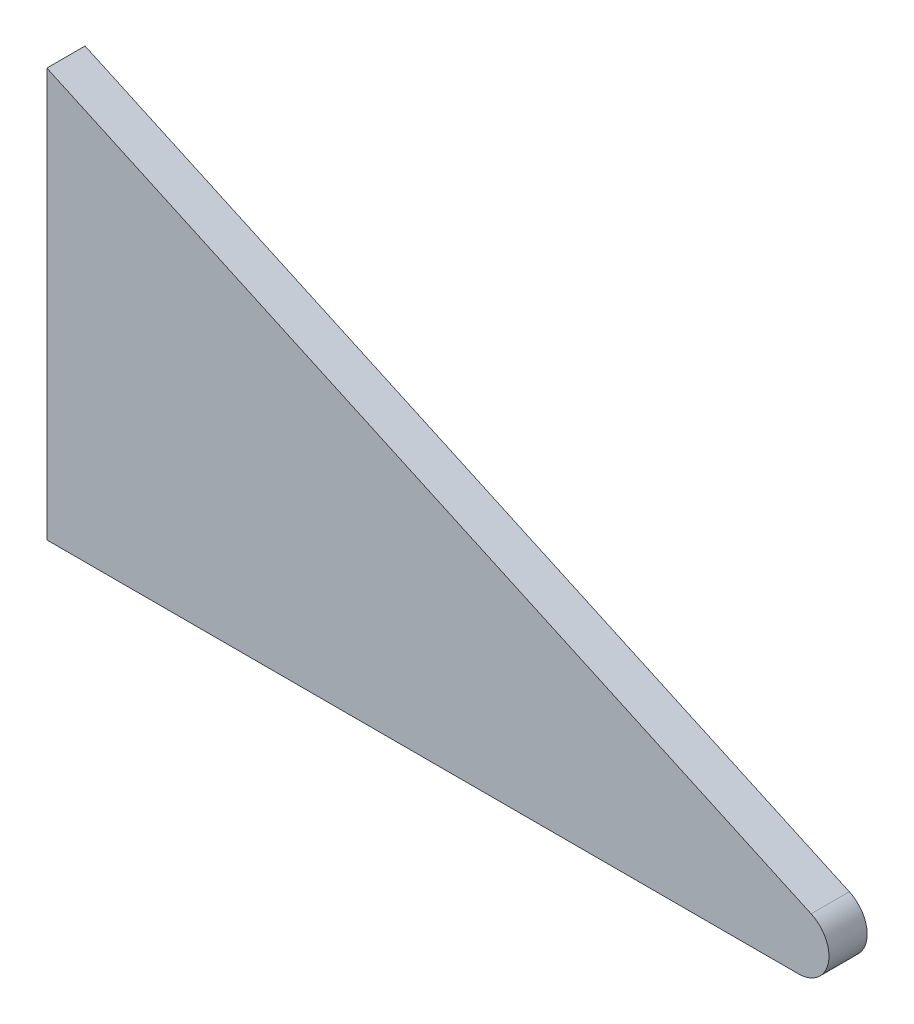
ISO-10303-21;
HEADER;
FILE_DESCRIPTION(('STEP AP214'),'2;1');
FILE_NAME('part.step','',(''),(''),'','','');
FILE_SCHEMA(('AUTOMOTIVE_DESIGN { 1 0 10303 214 1 1 1 1 }'));
ENDSEC;
DATA;
#1=APPLICATION_CONTEXT('core data for automotive mechanical design processes');
#2=APPLICATION_PROTOCOL_DEFINITION('international standard','automotive_design',2000,#1);
#3=PRODUCT_CONTEXT('',#1,'mechanical');
#4=PRODUCT('Part','Part','',(#3));
#5=PRODUCT_RELATED_PRODUCT_CATEGORY('part','',(#4));
#6=PRODUCT_DEFINITION_FORMATION('','',#4);
#7=PRODUCT_DEFINITION_CONTEXT('part definition',#1,'design');
#8=PRODUCT_DEFINITION('design','',#6,#7);
#9=PRODUCT_DEFINITION_SHAPE('','',#8);
#10=(LENGTH_UNIT() NAMED_UNIT(*) SI_UNIT(.MILLI.,.METRE.));
#11=(NAMED_UNIT(*) PLANE_ANGLE_UNIT() SI_UNIT($,.RADIAN.));
#12=(NAMED_UNIT(*) SI_UNIT($,.STERADIAN.) SOLID_ANGLE_UNIT());
#13=UNCERTAINTY_MEASURE_WITH_UNIT(LENGTH_MEASURE(1.E-05),#10,'distance_accuracy_value','');
#14=(GEOMETRIC_REPRESENTATION_CONTEXT(3) GLOBAL_UNCERTAINTY_ASSIGNED_CONTEXT((#13)) GLOBAL_UNIT_ASSIGNED_CONTEXT((#10,
#11,#12)) REPRESENTATION_CONTEXT('',''));
#15=CARTESIAN_POINT('',(0.,0.,0.));
#16=DIRECTION('',(0.,0.,1.));
#17=DIRECTION('',(1.,0.,0.));
#18=AXIS2_PLACEMENT_3D('',#15,#16,#17);
#19=CARTESIAN_POINT('',(152.62569751053,2.54,3.175));
#20=DIRECTION('',(0.,0.,-1.));
#21=DIRECTION('',(-1.,0.,0.));
#22=AXIS2_PLACEMENT_3D('',#19,#20,#21);
#23=CYLINDRICAL_SURFACE('',#22,2.54);
#24=CARTESIAN_POINT('',(152.62569751053,2.54,0.));
#25=DIRECTION('',(0.,0.,1.));
#26=DIRECTION('',(1.,0.,0.));
#27=AXIS2_PLACEMENT_3D('',#24,#25,#26);
#28=CIRCLE('',#27,2.54);
#29=CARTESIAN_POINT('',(152.62569751053,0.,0.));
#30=VERTEX_POINT('',#29);
#31=CARTESIAN_POINT('',(153.684030843863,4.84901073093123,0.));
#32=VERTEX_POINT('',#31);
#33=EDGE_CURVE('E95',#30,#32,#28,.T.);
#34=ORIENTED_EDGE('',*,*,#33,.T.);
#35=DIRECTION('',(0.,0.,-1.));
#36=VECTOR('',#35,1.);
#37=CARTESIAN_POINT('',(153.684030843863,4.84901073093123,3.175));
#38=LINE('',#37,#36);
#39=CARTESIAN_POINT('',(153.684030843863,4.84901073093123,3.175));
#40=VERTEX_POINT('',#39);
#41=EDGE_CURVE('E11',#40,#32,#38,.T.);
#42=ORIENTED_EDGE('',*,*,#41,.F.);
#43=CARTESIAN_POINT('',(152.62569751053,2.54,3.175));
#44=DIRECTION('',(0.,0.,1.));
#45=DIRECTION('',(1.,0.,0.));
#46=AXIS2_PLACEMENT_3D('',#43,#44,#45);
#47=CIRCLE('',#46,2.54);
#48=CARTESIAN_POINT('',(152.62569751053,0.,3.175));
#49=VERTEX_POINT('',#48);
#50=EDGE_CURVE('E83',#49,#40,#47,.T.);
#51=ORIENTED_EDGE('',*,*,#50,.F.);
#52=DIRECTION('',(0.,0.,-1.));
#53=VECTOR('',#52,1.);
#54=CARTESIAN_POINT('',(152.62569751053,0.,3.175));
#55=LINE('',#54,#53);
#56=EDGE_CURVE('E91',#49,#30,#55,.T.);
#57=ORIENTED_EDGE('',*,*,#56,.T.);
#58=EDGE_LOOP('',(#34,#42,#51,#57));
#59=FACE_BOUND('',#58,.T.);
#60=ADVANCED_FACE('F32',(#59),#23,.T.);
#61=CARTESIAN_POINT('',(153.684030843863,4.84901073093123,3.175));
#62=DIRECTION('',(-0.416666666666661,-0.909059342886312,0.));
#63=DIRECTION('',(0.909059342886312,-0.416666666666661,0.));
#64=AXIS2_PLACEMENT_3D('',#61,#62,#63);
#65=PLANE('',#64);
#66=DIRECTION('',(-0.909059342886312,0.416666666666661,0.));
#67=VECTOR('',#66,1.);
#68=CARTESIAN_POINT('',(153.684030843863,4.84901073093123,0.));
#69=LINE('',#68,#67);
#70=CARTESIAN_POINT('',(90.1840308438635,33.9541880115764,0.));
#71=VERTEX_POINT('',#70);
#72=EDGE_CURVE('E87',#32,#71,#69,.T.);
#73=ORIENTED_EDGE('',*,*,#72,.T.);
#74=DIRECTION('',(0.,0.,-1.));
#75=VECTOR('',#74,1.);
#76=CARTESIAN_POINT('',(90.1840308438635,33.9541880115764,3.175));
#77=LINE('',#76,#75);
#78=CARTESIAN_POINT('',(90.1840308438635,33.9541880115764,3.175));
#79=VERTEX_POINT('',#78);
#80=EDGE_CURVE('E40',#79,#71,#77,.T.);
#81=ORIENTED_EDGE('',*,*,#80,.F.);
#82=DIRECTION('',(-0.909059342886312,0.416666666666661,0.));
#83=VECTOR('',#82,1.);
#84=CARTESIAN_POINT('',(153.684030843863,4.84901073093123,3.175));
#85=LINE('',#84,#83);
#86=EDGE_CURVE('E78',#40,#79,#85,.T.);
#87=ORIENTED_EDGE('',*,*,#86,.F.);
#88=ORIENTED_EDGE('',*,*,#41,.T.);
#89=EDGE_LOOP('',(#73,#81,#87,#88));
#90=FACE_BOUND('',#89,.T.);
#91=ADVANCED_FACE('F86',(#90),#65,.F.);
#92=CARTESIAN_POINT('',(90.1840308438635,0.,3.175));
#93=DIRECTION('',(1.,0.,0.));
#94=DIRECTION('',(0.,0.,-1.));
#95=AXIS2_PLACEMENT_3D('',#92,#93,#94);
#96=PLANE('',#95);
#97=DIRECTION('',(0.,-1.,0.));
#98=VECTOR('',#97,1.);
#99=CARTESIAN_POINT('',(90.1840308438635,0.,0.));
#100=LINE('',#99,#98);
#101=CARTESIAN_POINT('',(90.1840308438635,0.,0.));
#102=VERTEX_POINT('',#101);
#103=EDGE_CURVE('E65',#71,#102,#100,.T.);
#104=ORIENTED_EDGE('',*,*,#103,.T.);
#105=DIRECTION('',(0.,0.,-1.));
#106=VECTOR('',#105,1.);
#107=CARTESIAN_POINT('',(90.1840308438635,0.,3.175));
#108=LINE('',#107,#106);
#109=CARTESIAN_POINT('',(90.1840308438635,0.,3.175));
#110=VERTEX_POINT('',#109);
#111=EDGE_CURVE('E88',#110,#102,#108,.T.);
#112=ORIENTED_EDGE('',*,*,#111,.F.);
#113=DIRECTION('',(0.,-1.,0.));
#114=VECTOR('',#113,1.);
#115=CARTESIAN_POINT('',(90.1840308438635,0.,3.175));
#116=LINE('',#115,#114);
#117=EDGE_CURVE('E81',#79,#110,#116,.T.);
#118=ORIENTED_EDGE('',*,*,#117,.F.);
#119=ORIENTED_EDGE('',*,*,#80,.T.);
#120=EDGE_LOOP('',(#104,#112,#118,#119));
#121=FACE_BOUND('',#120,.T.);
#122=ADVANCED_FACE('F89',(#121),#96,.F.);
#123=CARTESIAN_POINT('',(90.1840308438635,0.,3.175));
#124=DIRECTION('',(0.,1.,0.));
#125=DIRECTION('',(0.,0.,1.));
#126=AXIS2_PLACEMENT_3D('',#123,#124,#125);
#127=PLANE('',#126);
#128=DIRECTION('',(1.,0.,0.));
#129=VECTOR('',#128,1.);
#130=CARTESIAN_POINT('',(90.1840308438635,0.,0.));
#131=LINE('',#130,#129);
#132=EDGE_CURVE('E71',#102,#30,#131,.T.);
#133=ORIENTED_EDGE('',*,*,#132,.T.);
#134=ORIENTED_EDGE('',*,*,#56,.F.);
#135=DIRECTION('',(1.,0.,0.));
#136=VECTOR('',#135,1.);
#137=CARTESIAN_POINT('',(90.1840308438635,0.,3.175));
#138=LINE('',#137,#136);
#139=EDGE_CURVE('E48',#110,#49,#138,.T.);
#140=ORIENTED_EDGE('',*,*,#139,.F.);
#141=ORIENTED_EDGE('',*,*,#111,.T.);
#142=EDGE_LOOP('',(#133,#134,#140,#141));
#143=FACE_BOUND('',#142,.T.);
#144=ADVANCED_FACE('F102',(#143),#127,.F.);
#145=CARTESIAN_POINT('',(152.62569751053,2.54,3.175));
#146=DIRECTION('',(0.,0.,1.));
#147=DIRECTION('',(1.,0.,0.));
#148=AXIS2_PLACEMENT_3D('',#145,#146,#147);
#149=PLANE('',#148);
#150=ORIENTED_EDGE('',*,*,#50,.T.);
#151=ORIENTED_EDGE('',*,*,#86,.T.);
#152=ORIENTED_EDGE('',*,*,#117,.T.);
#153=ORIENTED_EDGE('',*,*,#139,.T.);
#154=EDGE_LOOP('',(#150,#151,#152,#153));
#155=FACE_BOUND('',#154,.T.);
#156=ADVANCED_FACE('F79',(#155),#149,.T.);
#157=CARTESIAN_POINT('',(152.62569751053,2.54,0.));
#158=DIRECTION('',(0.,0.,1.));
#159=DIRECTION('',(1.,0.,0.));
#160=AXIS2_PLACEMENT_3D('',#157,#158,#159);
#161=PLANE('',#160);
#162=ORIENTED_EDGE('',*,*,#33,.F.);
#163=ORIENTED_EDGE('',*,*,#132,.F.);
#164=ORIENTED_EDGE('',*,*,#103,.F.);
#165=ORIENTED_EDGE('',*,*,#72,.F.);
#166=EDGE_LOOP('',(#162,#163,#164,#165));
#167=FACE_BOUND('',#166,.T.);
#168=ADVANCED_FACE('F105',(#167),#161,.F.);
#169=CLOSED_SHELL('',(#60,#91,#122,#144,#156,#168));
#170=MANIFOLD_SOLID_BREP('B2',#169);
#171=ADVANCED_BREP_SHAPE_REPRESENTATION('',(#18,#170),#14);
#172=SHAPE_DEFINITION_REPRESENTATION(#9,#171);
ENDSEC;
END-ISO-10303-21;
